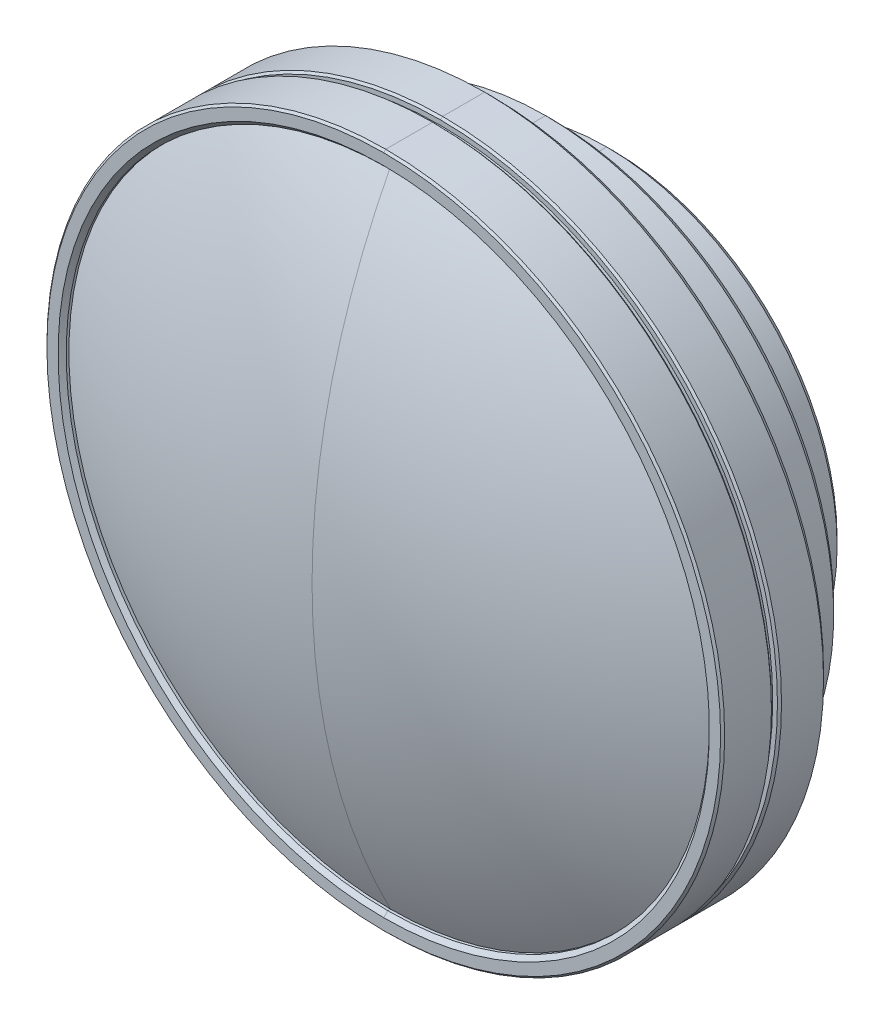
ISO-10303-21;
HEADER;
FILE_DESCRIPTION(('STEP AP214'),'2;1');
FILE_NAME('part.step','',(''),(''),'','','');
FILE_SCHEMA(('AUTOMOTIVE_DESIGN { 1 0 10303 214 1 1 1 1 }'));
ENDSEC;
DATA;
#1=APPLICATION_CONTEXT('core data for automotive mechanical design processes');
#2=APPLICATION_PROTOCOL_DEFINITION('international standard','automotive_design',2000,#1);
#3=PRODUCT_CONTEXT('',#1,'mechanical');
#4=PRODUCT('Part','Part','',(#3));
#5=PRODUCT_RELATED_PRODUCT_CATEGORY('part','',(#4));
#6=PRODUCT_DEFINITION_FORMATION('','',#4);
#7=PRODUCT_DEFINITION_CONTEXT('part definition',#1,'design');
#8=PRODUCT_DEFINITION('design','',#6,#7);
#9=PRODUCT_DEFINITION_SHAPE('','',#8);
#10=(LENGTH_UNIT() NAMED_UNIT(*) SI_UNIT(.MILLI.,.METRE.));
#11=(NAMED_UNIT(*) PLANE_ANGLE_UNIT() SI_UNIT($,.RADIAN.));
#12=(NAMED_UNIT(*) SI_UNIT($,.STERADIAN.) SOLID_ANGLE_UNIT());
#13=UNCERTAINTY_MEASURE_WITH_UNIT(LENGTH_MEASURE(1.E-05),#10,'distance_accuracy_value','');
#14=(GEOMETRIC_REPRESENTATION_CONTEXT(3) GLOBAL_UNCERTAINTY_ASSIGNED_CONTEXT((#13)) GLOBAL_UNIT_ASSIGNED_CONTEXT((#10,
#11,#12)) REPRESENTATION_CONTEXT('',''));
#15=CARTESIAN_POINT('',(0.,0.,0.));
#16=DIRECTION('',(0.,0.,1.));
#17=DIRECTION('',(1.,0.,0.));
#18=AXIS2_PLACEMENT_3D('',#15,#16,#17);
#19=CARTESIAN_POINT('',(0.,0.,9.1));
#20=DIRECTION('',(0.,0.,-1.));
#21=DIRECTION('',(0.,-1.,0.));
#22=AXIS2_PLACEMENT_3D('',#19,#20,#21);
#23=PLANE('',#22);
#24=CARTESIAN_POINT('',(0.,0.,9.1));
#25=DIRECTION('',(0.,0.,-1.));
#26=DIRECTION('',(0.,1.,0.));
#27=AXIS2_PLACEMENT_3D('',#24,#25,#26);
#28=CIRCLE('',#27,23.25);
#29=CARTESIAN_POINT('',(0.,23.25,9.1));
#30=VERTEX_POINT('',#29);
#31=CARTESIAN_POINT('',(0.,-23.25,9.1));
#32=VERTEX_POINT('',#31);
#33=EDGE_CURVE('E325',#30,#32,#28,.T.);
#34=ORIENTED_EDGE('',*,*,#33,.T.);
#35=CARTESIAN_POINT('',(0.,0.,9.1));
#36=DIRECTION('',(0.,0.,1.));
#37=DIRECTION('',(0.,1.,0.));
#38=AXIS2_PLACEMENT_3D('',#35,#36,#37);
#39=CIRCLE('',#38,23.25);
#40=EDGE_CURVE('E354',#30,#32,#39,.T.);
#41=ORIENTED_EDGE('',*,*,#40,.F.);
#42=EDGE_LOOP('',(#34,#41));
#43=FACE_BOUND('',#42,.T.);
#44=ADVANCED_FACE('F15',(#43),#23,.T.);
#45=CARTESIAN_POINT('',(0.,0.,-49.53693829317));
#46=DIRECTION('',(0.,0.,-1.));
#47=DIRECTION('',(0.,-1.,0.));
#48=AXIS2_PLACEMENT_3D('',#45,#46,#47);
#49=SPHERICAL_SURFACE('',#48,103.0057371891);
#50=CARTESIAN_POINT('',(0.,0.,41.8888753147));
#51=DIRECTION('',(0.,0.,1.));
#52=DIRECTION('',(0.,1.,0.));
#53=AXIS2_PLACEMENT_3D('',#50,#51,#52);
#54=CIRCLE('',#53,47.45);
#55=CARTESIAN_POINT('',(0.,47.45,41.8888753147));
#56=VERTEX_POINT('',#55);
#57=CARTESIAN_POINT('',(0.,-47.45,41.8888753147));
#58=VERTEX_POINT('',#57);
#59=EDGE_CURVE('E344',#56,#58,#54,.T.);
#60=ORIENTED_EDGE('',*,*,#59,.T.);
#61=CARTESIAN_POINT('',(0.,0.,-49.53693829317));
#62=DIRECTION('',(-1.,0.,0.));
#63=DIRECTION('',(0.,-0.460653952826992,0.887579819365485));
#64=AXIS2_PLACEMENT_3D('',#61,#62,#63);
#65=CIRCLE('',#64,103.0057371891);
#66=CARTESIAN_POINT('',(0.,0.,53.46879889588));
#67=VERTEX_POINT('',#66);
#68=EDGE_CURVE('E26',#58,#67,#65,.T.);
#69=ORIENTED_EDGE('',*,*,#68,.T.);
#70=CARTESIAN_POINT('',(0.,0.,-49.53693829317));
#71=DIRECTION('',(1.,0.,0.));
#72=DIRECTION('',(0.,0.460653952826992,0.887579819365485));
#73=AXIS2_PLACEMENT_3D('',#70,#71,#72);
#74=CIRCLE('',#73,103.0057371891);
#75=EDGE_CURVE('E10',#56,#67,#74,.T.);
#76=ORIENTED_EDGE('',*,*,#75,.F.);
#77=EDGE_LOOP('',(#60,#69,#76));
#78=FACE_BOUND('',#77,.T.);
#79=ADVANCED_FACE('F531',(#78),#49,.T.);
#80=CARTESIAN_POINT('',(0.,0.,-49.53693829317));
#81=DIRECTION('',(0.,0.,-1.));
#82=DIRECTION('',(0.,-1.,0.));
#83=AXIS2_PLACEMENT_3D('',#80,#81,#82);
#84=SPHERICAL_SURFACE('',#83,103.0057371891);
#85=ORIENTED_EDGE('',*,*,#68,.F.);
#86=CARTESIAN_POINT('',(0.,0.,41.8888753147));
#87=DIRECTION('',(0.,0.,-1.));
#88=DIRECTION('',(0.,1.,0.));
#89=AXIS2_PLACEMENT_3D('',#86,#87,#88);
#90=CIRCLE('',#89,47.45);
#91=EDGE_CURVE('E310',#56,#58,#90,.T.);
#92=ORIENTED_EDGE('',*,*,#91,.F.);
#93=ORIENTED_EDGE('',*,*,#75,.T.);
#94=EDGE_LOOP('',(#85,#92,#93));
#95=FACE_BOUND('',#94,.T.);
#96=ADVANCED_FACE('F537',(#95),#84,.T.);
#97=CARTESIAN_POINT('',(0.,0.,56.14223884068));
#98=DIRECTION('',(0.,0.,-1.));
#99=DIRECTION('',(0.,-1.,0.));
#100=AXIS2_PLACEMENT_3D('',#97,#98,#99);
#101=CYLINDRICAL_SURFACE('',#100,47.45);
#102=ORIENTED_EDGE('',*,*,#91,.T.);
#103=DIRECTION('',(0.,0.,-1.));
#104=VECTOR('',#103,1.);
#105=CARTESIAN_POINT('',(0.,-47.45,42.2888753147));
#106=LINE('',#105,#104);
#107=CARTESIAN_POINT('',(0.,-47.45,42.2888753147));
#108=VERTEX_POINT('',#107);
#109=EDGE_CURVE('E340',#108,#58,#106,.T.);
#110=ORIENTED_EDGE('',*,*,#109,.F.);
#111=CARTESIAN_POINT('',(0.,0.,42.2888753147));
#112=DIRECTION('',(0.,0.,-1.));
#113=DIRECTION('',(0.,1.,0.));
#114=AXIS2_PLACEMENT_3D('',#111,#112,#113);
#115=CIRCLE('',#114,47.45);
#116=CARTESIAN_POINT('',(0.,47.45,42.2888753147));
#117=VERTEX_POINT('',#116);
#118=EDGE_CURVE('E451',#117,#108,#115,.T.);
#119=ORIENTED_EDGE('',*,*,#118,.F.);
#120=DIRECTION('',(0.,0.,-1.));
#121=VECTOR('',#120,1.);
#122=CARTESIAN_POINT('',(0.,47.45,42.2888753147));
#123=LINE('',#122,#121);
#124=EDGE_CURVE('E398',#117,#56,#123,.T.);
#125=ORIENTED_EDGE('',*,*,#124,.T.);
#126=EDGE_LOOP('',(#102,#110,#119,#125));
#127=FACE_BOUND('',#126,.T.);
#128=ADVANCED_FACE('F555',(#127),#101,.F.);
#129=CARTESIAN_POINT('',(0.,0.,56.14223884068));
#130=DIRECTION('',(0.,0.,-1.));
#131=DIRECTION('',(0.,-1.,0.));
#132=AXIS2_PLACEMENT_3D('',#129,#130,#131);
#133=CYLINDRICAL_SURFACE('',#132,47.45);
#134=CARTESIAN_POINT('',(0.,0.,42.2888753147));
#135=DIRECTION('',(0.,0.,1.));
#136=DIRECTION('',(0.,1.,0.));
#137=AXIS2_PLACEMENT_3D('',#134,#135,#136);
#138=CIRCLE('',#137,47.45);
#139=EDGE_CURVE('E270',#117,#108,#138,.T.);
#140=ORIENTED_EDGE('',*,*,#139,.T.);
#141=ORIENTED_EDGE('',*,*,#109,.T.);
#142=ORIENTED_EDGE('',*,*,#59,.F.);
#143=ORIENTED_EDGE('',*,*,#124,.F.);
#144=EDGE_LOOP('',(#140,#141,#142,#143));
#145=FACE_BOUND('',#144,.T.);
#146=ADVANCED_FACE('F558',(#145),#133,.F.);
#147=CARTESIAN_POINT('',(0.,0.,42.5888753147));
#148=DIRECTION('',(0.,0.,1.));
#149=DIRECTION('',(0.,1.,0.));
#150=AXIS2_PLACEMENT_3D('',#147,#148,#149);
#151=CONICAL_SURFACE('',#150,47.75,0.785398163397125);
#152=CARTESIAN_POINT('',(0.,0.,42.8888753147));
#153=DIRECTION('',(0.,0.,1.));
#154=DIRECTION('',(0.,1.,0.));
#155=AXIS2_PLACEMENT_3D('',#152,#153,#154);
#156=CIRCLE('',#155,48.05);
#157=CARTESIAN_POINT('',(0.,48.05,42.8888753147));
#158=VERTEX_POINT('',#157);
#159=CARTESIAN_POINT('',(0.,-48.05,42.8888753147));
#160=VERTEX_POINT('',#159);
#161=EDGE_CURVE('E335',#158,#160,#156,.T.);
#162=ORIENTED_EDGE('',*,*,#161,.T.);
#163=DIRECTION('',(0.,0.707106781186398,-0.707106781186698));
#164=VECTOR('',#163,1.);
#165=CARTESIAN_POINT('',(0.,-48.05,42.8888753147));
#166=LINE('',#165,#164);
#167=EDGE_CURVE('E271',#160,#108,#166,.T.);
#168=ORIENTED_EDGE('',*,*,#167,.T.);
#169=ORIENTED_EDGE('',*,*,#139,.F.);
#170=DIRECTION('',(0.,-0.707106781186398,-0.707106781186698));
#171=VECTOR('',#170,1.);
#172=CARTESIAN_POINT('',(0.,48.05,42.8888753147));
#173=LINE('',#172,#171);
#174=EDGE_CURVE('E266',#158,#117,#173,.T.);
#175=ORIENTED_EDGE('',*,*,#174,.F.);
#176=EDGE_LOOP('',(#162,#168,#169,#175));
#177=FACE_BOUND('',#176,.T.);
#178=ADVANCED_FACE('F622',(#177),#151,.F.);
#179=CARTESIAN_POINT('',(0.,0.,42.5888753147));
#180=DIRECTION('',(0.,0.,1.));
#181=DIRECTION('',(0.,1.,0.));
#182=AXIS2_PLACEMENT_3D('',#179,#180,#181);
#183=CONICAL_SURFACE('',#182,47.75,0.785398163397125);
#184=ORIENTED_EDGE('',*,*,#118,.T.);
#185=ORIENTED_EDGE('',*,*,#167,.F.);
#186=CARTESIAN_POINT('',(0.,0.,42.8888753147));
#187=DIRECTION('',(0.,0.,-1.));
#188=DIRECTION('',(0.,1.,0.));
#189=AXIS2_PLACEMENT_3D('',#186,#187,#188);
#190=CIRCLE('',#189,48.05);
#191=EDGE_CURVE('E338',#158,#160,#190,.T.);
#192=ORIENTED_EDGE('',*,*,#191,.F.);
#193=ORIENTED_EDGE('',*,*,#174,.T.);
#194=EDGE_LOOP('',(#184,#185,#192,#193));
#195=FACE_BOUND('',#194,.T.);
#196=ADVANCED_FACE('F624',(#195),#183,.F.);
#197=CARTESIAN_POINT('',(0.,0.,42.8888753147));
#198=DIRECTION('',(0.,0.,-1.));
#199=DIRECTION('',(0.,-1.,0.));
#200=AXIS2_PLACEMENT_3D('',#197,#198,#199);
#201=PLANE('',#200);
#202=ORIENTED_EDGE('',*,*,#161,.F.);
#203=ORIENTED_EDGE('',*,*,#191,.T.);
#204=EDGE_LOOP('',(#202,#203));
#205=FACE_BOUND('',#204,.T.);
#206=CARTESIAN_POINT('',(0.,0.,42.88887531506));
#207=DIRECTION('',(0.,0.,-1.));
#208=DIRECTION('',(0.,1.,0.));
#209=AXIS2_PLACEMENT_3D('',#206,#207,#208);
#210=CIRCLE('',#209,49.69999999964);
#211=CARTESIAN_POINT('',(0.,49.69999999976,42.88887531494));
#212=VERTEX_POINT('',#211);
#213=CARTESIAN_POINT('',(0.,-49.69999999976,42.88887531494));
#214=VERTEX_POINT('',#213);
#215=EDGE_CURVE('E299',#212,#214,#210,.T.);
#216=ORIENTED_EDGE('',*,*,#215,.F.);
#217=CARTESIAN_POINT('',(0.,0.,42.88887531506));
#218=DIRECTION('',(0.,0.,1.));
#219=DIRECTION('',(0.,1.,0.));
#220=AXIS2_PLACEMENT_3D('',#217,#218,#219);
#221=CIRCLE('',#220,49.69999999964);
#222=EDGE_CURVE('E334',#212,#214,#221,.T.);
#223=ORIENTED_EDGE('',*,*,#222,.T.);
#224=EDGE_LOOP('',(#216,#223));
#225=FACE_BOUND('',#224,.T.);
#226=ADVANCED_FACE('F547',(#205,#225),#201,.F.);
#227=CARTESIAN_POINT('',(0.,0.,42.73887531488));
#228=DIRECTION('',(0.,0.,-1.));
#229=DIRECTION('',(0.,-1.,0.));
#230=AXIS2_PLACEMENT_3D('',#227,#228,#229);
#231=CONICAL_SURFACE('',#230,49.84999999982,0.7853981633973);
#232=CARTESIAN_POINT('',(0.,0.,42.5888753147));
#233=DIRECTION('',(0.,0.,1.));
#234=DIRECTION('',(0.,1.,0.));
#235=AXIS2_PLACEMENT_3D('',#232,#233,#234);
#236=CIRCLE('',#235,50.);
#237=CARTESIAN_POINT('',(0.,50.,42.5888753147));
#238=VERTEX_POINT('',#237);
#239=CARTESIAN_POINT('',(0.,-50.,42.5888753147));
#240=VERTEX_POINT('',#239);
#241=EDGE_CURVE('E424',#238,#240,#236,.T.);
#242=ORIENTED_EDGE('',*,*,#241,.T.);
#243=DIRECTION('',(0.,0.707106781186598,0.707106781186498));
#244=VECTOR('',#243,1.);
#245=CARTESIAN_POINT('',(0.,-50.,42.5888753147));
#246=LINE('',#245,#244);
#247=EDGE_CURVE('E303',#240,#214,#246,.T.);
#248=ORIENTED_EDGE('',*,*,#247,.T.);
#249=ORIENTED_EDGE('',*,*,#222,.F.);
#250=DIRECTION('',(0.,-0.707106781186598,0.707106781186498));
#251=VECTOR('',#250,1.);
#252=CARTESIAN_POINT('',(0.,50.,42.5888753147));
#253=LINE('',#252,#251);
#254=EDGE_CURVE('E330',#238,#212,#253,.T.);
#255=ORIENTED_EDGE('',*,*,#254,.F.);
#256=EDGE_LOOP('',(#242,#248,#249,#255));
#257=FACE_BOUND('',#256,.T.);
#258=ADVANCED_FACE('F543',(#257),#231,.T.);
#259=CARTESIAN_POINT('',(0.,0.,42.73887531488));
#260=DIRECTION('',(0.,0.,-1.));
#261=DIRECTION('',(0.,-1.,0.));
#262=AXIS2_PLACEMENT_3D('',#259,#260,#261);
#263=CONICAL_SURFACE('',#262,49.84999999982,0.7853981633973);
#264=ORIENTED_EDGE('',*,*,#215,.T.);
#265=ORIENTED_EDGE('',*,*,#247,.F.);
#266=CARTESIAN_POINT('',(0.,0.,42.5888753147));
#267=DIRECTION('',(0.,0.,-1.));
#268=DIRECTION('',(0.,1.,0.));
#269=AXIS2_PLACEMENT_3D('',#266,#267,#268);
#270=CIRCLE('',#269,50.);
#271=EDGE_CURVE('E304',#238,#240,#270,.T.);
#272=ORIENTED_EDGE('',*,*,#271,.F.);
#273=ORIENTED_EDGE('',*,*,#254,.T.);
#274=EDGE_LOOP('',(#264,#265,#272,#273));
#275=FACE_BOUND('',#274,.T.);
#276=ADVANCED_FACE('F546',(#275),#263,.T.);
#277=CARTESIAN_POINT('',(0.,0.,56.14223884068));
#278=DIRECTION('',(0.,0.,-1.));
#279=DIRECTION('',(0.,-1.,0.));
#280=AXIS2_PLACEMENT_3D('',#277,#278,#279);
#281=CYLINDRICAL_SURFACE('',#280,50.);
#282=ORIENTED_EDGE('',*,*,#271,.T.);
#283=DIRECTION('',(0.,0.,1.));
#284=VECTOR('',#283,1.);
#285=CARTESIAN_POINT('',(0.,-50.,35.6888753147));
#286=LINE('',#285,#284);
#287=CARTESIAN_POINT('',(0.,-50.,35.6888753147));
#288=VERTEX_POINT('',#287);
#289=EDGE_CURVE('E378',#288,#240,#286,.T.);
#290=ORIENTED_EDGE('',*,*,#289,.F.);
#291=CARTESIAN_POINT('',(0.,0.,35.6888753147));
#292=DIRECTION('',(0.,0.,-1.));
#293=DIRECTION('',(0.,1.,0.));
#294=AXIS2_PLACEMENT_3D('',#291,#292,#293);
#295=CIRCLE('',#294,50.);
#296=CARTESIAN_POINT('',(0.,50.,35.6888753147));
#297=VERTEX_POINT('',#296);
#298=EDGE_CURVE('E247',#297,#288,#295,.T.);
#299=ORIENTED_EDGE('',*,*,#298,.F.);
#300=DIRECTION('',(0.,0.,1.));
#301=VECTOR('',#300,1.);
#302=CARTESIAN_POINT('',(0.,50.,35.6888753147));
#303=LINE('',#302,#301);
#304=EDGE_CURVE('E421',#297,#238,#303,.T.);
#305=ORIENTED_EDGE('',*,*,#304,.T.);
#306=EDGE_LOOP('',(#282,#290,#299,#305));
#307=FACE_BOUND('',#306,.T.);
#308=ADVANCED_FACE('F610',(#307),#281,.T.);
#309=CARTESIAN_POINT('',(0.,0.,56.14223884068));
#310=DIRECTION('',(0.,0.,-1.));
#311=DIRECTION('',(0.,-1.,0.));
#312=AXIS2_PLACEMENT_3D('',#309,#310,#311);
#313=CYLINDRICAL_SURFACE('',#312,50.);
#314=CARTESIAN_POINT('',(0.,0.,35.6888753147));
#315=DIRECTION('',(0.,0.,1.));
#316=DIRECTION('',(0.,1.,0.));
#317=AXIS2_PLACEMENT_3D('',#314,#315,#316);
#318=CIRCLE('',#317,50.);
#319=EDGE_CURVE('E374',#297,#288,#318,.T.);
#320=ORIENTED_EDGE('',*,*,#319,.T.);
#321=ORIENTED_EDGE('',*,*,#289,.T.);
#322=ORIENTED_EDGE('',*,*,#241,.F.);
#323=ORIENTED_EDGE('',*,*,#304,.F.);
#324=EDGE_LOOP('',(#320,#321,#322,#323));
#325=FACE_BOUND('',#324,.T.);
#326=ADVANCED_FACE('F606',(#325),#313,.T.);
#327=CARTESIAN_POINT('',(0.,0.,35.53887531459));
#328=DIRECTION('',(0.,0.,1.));
#329=DIRECTION('',(0.,1.,0.));
#330=AXIS2_PLACEMENT_3D('',#327,#328,#329);
#331=CONICAL_SURFACE('',#330,49.8499999999,0.7853981633973);
#332=CARTESIAN_POINT('',(0.,0.,35.38887531449));
#333=DIRECTION('',(0.,0.,1.));
#334=DIRECTION('',(0.,1.,0.));
#335=AXIS2_PLACEMENT_3D('',#332,#333,#334);
#336=CIRCLE('',#335,49.69999999979);
#337=CARTESIAN_POINT('',(0.,49.69999999979,35.38887531449));
#338=VERTEX_POINT('',#337);
#339=CARTESIAN_POINT('',(0.,-49.69999999979,35.38887531449));
#340=VERTEX_POINT('',#339);
#341=EDGE_CURVE('E280',#338,#340,#336,.T.);
#342=ORIENTED_EDGE('',*,*,#341,.T.);
#343=DIRECTION('',(0.,-0.707106781186498,0.707106781186597));
#344=VECTOR('',#343,1.);
#345=CARTESIAN_POINT('',(0.,-49.69999999979,35.38887531449));
#346=LINE('',#345,#344);
#347=EDGE_CURVE('E251',#340,#288,#346,.T.);
#348=ORIENTED_EDGE('',*,*,#347,.T.);
#349=ORIENTED_EDGE('',*,*,#319,.F.);
#350=DIRECTION('',(0.,0.707106781186498,0.707106781186597));
#351=VECTOR('',#350,1.);
#352=CARTESIAN_POINT('',(0.,49.69999999979,35.38887531449));
#353=LINE('',#352,#351);
#354=EDGE_CURVE('E19',#338,#297,#353,.T.);
#355=ORIENTED_EDGE('',*,*,#354,.F.);
#356=EDGE_LOOP('',(#342,#348,#349,#355));
#357=FACE_BOUND('',#356,.T.);
#358=ADVANCED_FACE('F609',(#357),#331,.T.);
#359=CARTESIAN_POINT('',(0.,0.,35.53887531459));
#360=DIRECTION('',(0.,0.,1.));
#361=DIRECTION('',(0.,1.,0.));
#362=AXIS2_PLACEMENT_3D('',#359,#360,#361);
#363=CONICAL_SURFACE('',#362,49.8499999999,0.7853981633973);
#364=ORIENTED_EDGE('',*,*,#298,.T.);
#365=ORIENTED_EDGE('',*,*,#347,.F.);
#366=CARTESIAN_POINT('',(0.,0.,35.38887531449));
#367=DIRECTION('',(0.,0.,-1.));
#368=DIRECTION('',(0.,1.,0.));
#369=AXIS2_PLACEMENT_3D('',#366,#367,#368);
#370=CIRCLE('',#369,49.69999999979);
#371=EDGE_CURVE('E252',#338,#340,#370,.T.);
#372=ORIENTED_EDGE('',*,*,#371,.F.);
#373=ORIENTED_EDGE('',*,*,#354,.T.);
#374=EDGE_LOOP('',(#364,#365,#372,#373));
#375=FACE_BOUND('',#374,.T.);
#376=ADVANCED_FACE('F659',(#375),#363,.T.);
#377=CARTESIAN_POINT('',(0.,0.,35.38887531449));
#378=DIRECTION('',(0.,0.,-1.));
#379=DIRECTION('',(0.,-1.,0.));
#380=AXIS2_PLACEMENT_3D('',#377,#378,#379);
#381=PLANE('',#380);
#382=CARTESIAN_POINT('',(0.,0.,35.38887531449));
#383=DIRECTION('',(0.,0.,-1.));
#384=DIRECTION('',(0.,1.,0.));
#385=AXIS2_PLACEMENT_3D('',#382,#383,#384);
#386=CIRCLE('',#385,49.);
#387=CARTESIAN_POINT('',(0.,49.,35.38887531449));
#388=VERTEX_POINT('',#387);
#389=CARTESIAN_POINT('',(0.,-49.,35.38887531449));
#390=VERTEX_POINT('',#389);
#391=EDGE_CURVE('E227',#388,#390,#386,.T.);
#392=ORIENTED_EDGE('',*,*,#391,.F.);
#393=CARTESIAN_POINT('',(0.,0.,35.38887531449));
#394=DIRECTION('',(0.,0.,1.));
#395=DIRECTION('',(0.,1.,0.));
#396=AXIS2_PLACEMENT_3D('',#393,#394,#395);
#397=CIRCLE('',#396,49.);
#398=EDGE_CURVE('E215',#388,#390,#397,.T.);
#399=ORIENTED_EDGE('',*,*,#398,.T.);
#400=EDGE_LOOP('',(#392,#399));
#401=FACE_BOUND('',#400,.T.);
#402=ORIENTED_EDGE('',*,*,#341,.F.);
#403=ORIENTED_EDGE('',*,*,#371,.T.);
#404=EDGE_LOOP('',(#402,#403));
#405=FACE_BOUND('',#404,.T.);
#406=ADVANCED_FACE('F662',(#401,#405),#381,.T.);
#407=CARTESIAN_POINT('',(0.,0.,56.14223884068));
#408=DIRECTION('',(0.,0.,-1.));
#409=DIRECTION('',(0.,-1.,0.));
#410=AXIS2_PLACEMENT_3D('',#407,#408,#409);
#411=CYLINDRICAL_SURFACE('',#410,49.);
#412=CARTESIAN_POINT('',(0.,0.,34.5));
#413=DIRECTION('',(0.,0.,1.));
#414=DIRECTION('',(0.,1.,0.));
#415=AXIS2_PLACEMENT_3D('',#412,#413,#414);
#416=CIRCLE('',#415,49.);
#417=CARTESIAN_POINT('',(0.,49.,34.5));
#418=VERTEX_POINT('',#417);
#419=CARTESIAN_POINT('',(0.,-49.,34.5));
#420=VERTEX_POINT('',#419);
#421=EDGE_CURVE('E214',#418,#420,#416,.T.);
#422=ORIENTED_EDGE('',*,*,#421,.T.);
#423=DIRECTION('',(0.,0.,1.));
#424=VECTOR('',#423,1.);
#425=CARTESIAN_POINT('',(0.,-49.,34.5));
#426=LINE('',#425,#424);
#427=EDGE_CURVE('E220',#420,#390,#426,.T.);
#428=ORIENTED_EDGE('',*,*,#427,.T.);
#429=ORIENTED_EDGE('',*,*,#398,.F.);
#430=DIRECTION('',(0.,0.,1.));
#431=VECTOR('',#430,1.);
#432=CARTESIAN_POINT('',(0.,49.,34.5));
#433=LINE('',#432,#431);
#434=EDGE_CURVE('E210',#418,#388,#433,.T.);
#435=ORIENTED_EDGE('',*,*,#434,.F.);
#436=EDGE_LOOP('',(#422,#428,#429,#435));
#437=FACE_BOUND('',#436,.T.);
#438=ADVANCED_FACE('F17',(#437),#411,.T.);
#439=CARTESIAN_POINT('',(0.,0.,56.14223884068));
#440=DIRECTION('',(0.,0.,-1.));
#441=DIRECTION('',(0.,-1.,0.));
#442=AXIS2_PLACEMENT_3D('',#439,#440,#441);
#443=CYLINDRICAL_SURFACE('',#442,49.);
#444=ORIENTED_EDGE('',*,*,#391,.T.);
#445=ORIENTED_EDGE('',*,*,#427,.F.);
#446=CARTESIAN_POINT('',(0.,0.,34.5));
#447=DIRECTION('',(0.,0.,-1.));
#448=DIRECTION('',(0.,1.,0.));
#449=AXIS2_PLACEMENT_3D('',#446,#447,#448);
#450=CIRCLE('',#449,49.);
#451=EDGE_CURVE('E223',#418,#420,#450,.T.);
#452=ORIENTED_EDGE('',*,*,#451,.F.);
#453=ORIENTED_EDGE('',*,*,#434,.T.);
#454=EDGE_LOOP('',(#444,#445,#452,#453));
#455=FACE_BOUND('',#454,.T.);
#456=ADVANCED_FACE('F224',(#455),#443,.T.);
#457=CARTESIAN_POINT('',(0.,0.,34.5));
#458=DIRECTION('',(0.,0.,-1.));
#459=DIRECTION('',(0.,-1.,0.));
#460=AXIS2_PLACEMENT_3D('',#457,#458,#459);
#461=PLANE('',#460);
#462=ORIENTED_EDGE('',*,*,#421,.F.);
#463=ORIENTED_EDGE('',*,*,#451,.T.);
#464=EDGE_LOOP('',(#462,#463));
#465=FACE_BOUND('',#464,.T.);
#466=CARTESIAN_POINT('',(0.,0.,34.50000000037));
#467=DIRECTION('',(0.,0.,-1.));
#468=DIRECTION('',(0.,1.,0.));
#469=AXIS2_PLACEMENT_3D('',#466,#467,#468);
#470=CIRCLE('',#469,49.69999999963);
#471=CARTESIAN_POINT('',(0.,49.69999999975,34.50000000025));
#472=VERTEX_POINT('',#471);
#473=CARTESIAN_POINT('',(0.,-49.69999999975,34.50000000025));
#474=VERTEX_POINT('',#473);
#475=EDGE_CURVE('E272',#472,#474,#470,.T.);
#476=ORIENTED_EDGE('',*,*,#475,.F.);
#477=CARTESIAN_POINT('',(0.,0.,34.50000000037));
#478=DIRECTION('',(0.,0.,1.));
#479=DIRECTION('',(0.,1.,0.));
#480=AXIS2_PLACEMENT_3D('',#477,#478,#479);
#481=CIRCLE('',#480,49.69999999963);
#482=EDGE_CURVE('E232',#472,#474,#481,.T.);
#483=ORIENTED_EDGE('',*,*,#482,.T.);
#484=EDGE_LOOP('',(#476,#483));
#485=FACE_BOUND('',#484,.T.);
#486=ADVANCED_FACE('F229',(#465,#485),#461,.F.);
#487=CARTESIAN_POINT('',(0.,0.,34.35000000019));
#488=DIRECTION('',(0.,0.,-1.));
#489=DIRECTION('',(0.,-1.,0.));
#490=AXIS2_PLACEMENT_3D('',#487,#488,#489);
#491=CONICAL_SURFACE('',#490,49.84999999981,0.7853981633973);
#492=CARTESIAN_POINT('',(0.,0.,34.2));
#493=DIRECTION('',(0.,0.,1.));
#494=DIRECTION('',(0.,1.,0.));
#495=AXIS2_PLACEMENT_3D('',#492,#493,#494);
#496=CIRCLE('',#495,50.);
#497=CARTESIAN_POINT('',(0.,50.,34.2));
#498=VERTEX_POINT('',#497);
#499=CARTESIAN_POINT('',(0.,-50.,34.2));
#500=VERTEX_POINT('',#499);
#501=EDGE_CURVE('E293',#498,#500,#496,.T.);
#502=ORIENTED_EDGE('',*,*,#501,.T.);
#503=DIRECTION('',(0.,0.707106781186597,0.707106781186498));
#504=VECTOR('',#503,1.);
#505=CARTESIAN_POINT('',(0.,-50.,34.2));
#506=LINE('',#505,#504);
#507=EDGE_CURVE('E276',#500,#474,#506,.T.);
#508=ORIENTED_EDGE('',*,*,#507,.T.);
#509=ORIENTED_EDGE('',*,*,#482,.F.);
#510=DIRECTION('',(0.,-0.707106781186597,0.707106781186498));
#511=VECTOR('',#510,1.);
#512=CARTESIAN_POINT('',(0.,50.,34.2));
#513=LINE('',#512,#511);
#514=EDGE_CURVE('E238',#498,#472,#513,.T.);
#515=ORIENTED_EDGE('',*,*,#514,.F.);
#516=EDGE_LOOP('',(#502,#508,#509,#515));
#517=FACE_BOUND('',#516,.T.);
#518=ADVANCED_FACE('F569',(#517),#491,.T.);
#519=CARTESIAN_POINT('',(0.,0.,34.35000000019));
#520=DIRECTION('',(0.,0.,-1.));
#521=DIRECTION('',(0.,-1.,0.));
#522=AXIS2_PLACEMENT_3D('',#519,#520,#521);
#523=CONICAL_SURFACE('',#522,49.84999999981,0.7853981633973);
#524=ORIENTED_EDGE('',*,*,#475,.T.);
#525=ORIENTED_EDGE('',*,*,#507,.F.);
#526=CARTESIAN_POINT('',(0.,0.,34.2));
#527=DIRECTION('',(0.,0.,-1.));
#528=DIRECTION('',(0.,1.,0.));
#529=AXIS2_PLACEMENT_3D('',#526,#527,#528);
#530=CIRCLE('',#529,50.);
#531=EDGE_CURVE('E277',#498,#500,#530,.T.);
#532=ORIENTED_EDGE('',*,*,#531,.F.);
#533=ORIENTED_EDGE('',*,*,#514,.T.);
#534=EDGE_LOOP('',(#524,#525,#532,#533));
#535=FACE_BOUND('',#534,.T.);
#536=ADVANCED_FACE('F567',(#535),#523,.T.);
#537=CARTESIAN_POINT('',(0.,0.,56.14223884068));
#538=DIRECTION('',(0.,0.,-1.));
#539=DIRECTION('',(0.,-1.,0.));
#540=AXIS2_PLACEMENT_3D('',#537,#538,#539);
#541=CYLINDRICAL_SURFACE('',#540,50.);
#542=ORIENTED_EDGE('',*,*,#531,.T.);
#543=DIRECTION('',(0.,0.,1.));
#544=VECTOR('',#543,1.);
#545=CARTESIAN_POINT('',(0.,-50.,28.));
#546=LINE('',#545,#544);
#547=CARTESIAN_POINT('',(0.,-50.,28.));
#548=VERTEX_POINT('',#547);
#549=EDGE_CURVE('E298',#548,#500,#546,.T.);
#550=ORIENTED_EDGE('',*,*,#549,.F.);
#551=CARTESIAN_POINT('',(0.,0.,28.));
#552=DIRECTION('',(0.,0.,-1.));
#553=DIRECTION('',(0.,1.,0.));
#554=AXIS2_PLACEMENT_3D('',#551,#552,#553);
#555=CIRCLE('',#554,50.);
#556=CARTESIAN_POINT('',(0.,50.,28.));
#557=VERTEX_POINT('',#556);
#558=EDGE_CURVE('E292',#557,#548,#555,.T.);
#559=ORIENTED_EDGE('',*,*,#558,.F.);
#560=DIRECTION('',(0.,0.,1.));
#561=VECTOR('',#560,1.);
#562=CARTESIAN_POINT('',(0.,50.,28.));
#563=LINE('',#562,#561);
#564=EDGE_CURVE('E297',#557,#498,#563,.T.);
#565=ORIENTED_EDGE('',*,*,#564,.T.);
#566=EDGE_LOOP('',(#542,#550,#559,#565));
#567=FACE_BOUND('',#566,.T.);
#568=ADVANCED_FACE('F563',(#567),#541,.T.);
#569=CARTESIAN_POINT('',(0.,0.,56.14223884068));
#570=DIRECTION('',(0.,0.,-1.));
#571=DIRECTION('',(0.,-1.,0.));
#572=AXIS2_PLACEMENT_3D('',#569,#570,#571);
#573=CYLINDRICAL_SURFACE('',#572,50.);
#574=CARTESIAN_POINT('',(0.,0.,28.));
#575=DIRECTION('',(0.,0.,1.));
#576=DIRECTION('',(0.,1.,0.));
#577=AXIS2_PLACEMENT_3D('',#574,#575,#576);
#578=CIRCLE('',#577,50.);
#579=EDGE_CURVE('E420',#557,#548,#578,.T.);
#580=ORIENTED_EDGE('',*,*,#579,.T.);
#581=ORIENTED_EDGE('',*,*,#549,.T.);
#582=ORIENTED_EDGE('',*,*,#501,.F.);
#583=ORIENTED_EDGE('',*,*,#564,.F.);
#584=EDGE_LOOP('',(#580,#581,#582,#583));
#585=FACE_BOUND('',#584,.T.);
#586=ADVANCED_FACE('F560',(#585),#573,.T.);
#587=CARTESIAN_POINT('',(0.,0.,27.49999999991));
#588=DIRECTION('',(0.,0.,1.));
#589=DIRECTION('',(0.,1.,0.));
#590=AXIS2_PLACEMENT_3D('',#587,#588,#589);
#591=CONICAL_SURFACE('',#590,49.49999999991,0.7853981633973);
#592=CARTESIAN_POINT('',(0.,0.,26.99999999982));
#593=DIRECTION('',(0.,0.,1.));
#594=DIRECTION('',(0.,1.,0.));
#595=AXIS2_PLACEMENT_3D('',#592,#593,#594);
#596=CIRCLE('',#595,48.99999999982);
#597=CARTESIAN_POINT('',(0.,48.99999999982,26.99999999982));
#598=VERTEX_POINT('',#597);
#599=CARTESIAN_POINT('',(0.,-48.99999999982,26.99999999982));
#600=VERTEX_POINT('',#599);
#601=EDGE_CURVE('E256',#598,#600,#596,.T.);
#602=ORIENTED_EDGE('',*,*,#601,.T.);
#603=DIRECTION('',(0.,-0.707106781186498,0.707106781186597));
#604=VECTOR('',#603,1.);
#605=CARTESIAN_POINT('',(0.,-48.99999999982,26.99999999982));
#606=LINE('',#605,#604);
#607=EDGE_CURVE('E358',#600,#548,#606,.T.);
#608=ORIENTED_EDGE('',*,*,#607,.T.);
#609=ORIENTED_EDGE('',*,*,#579,.F.);
#610=DIRECTION('',(0.,0.707106781186498,0.707106781186597));
#611=VECTOR('',#610,1.);
#612=CARTESIAN_POINT('',(0.,48.99999999982,26.99999999982));
#613=LINE('',#612,#611);
#614=EDGE_CURVE('E392',#598,#557,#613,.T.);
#615=ORIENTED_EDGE('',*,*,#614,.F.);
#616=EDGE_LOOP('',(#602,#608,#609,#615));
#617=FACE_BOUND('',#616,.T.);
#618=ADVANCED_FACE('F562',(#617),#591,.T.);
#619=CARTESIAN_POINT('',(0.,0.,27.49999999991));
#620=DIRECTION('',(0.,0.,1.));
#621=DIRECTION('',(0.,1.,0.));
#622=AXIS2_PLACEMENT_3D('',#619,#620,#621);
#623=CONICAL_SURFACE('',#622,49.49999999991,0.7853981633973);
#624=ORIENTED_EDGE('',*,*,#558,.T.);
#625=ORIENTED_EDGE('',*,*,#607,.F.);
#626=CARTESIAN_POINT('',(0.,0.,26.99999999982));
#627=DIRECTION('',(0.,0.,-1.));
#628=DIRECTION('',(0.,1.,0.));
#629=AXIS2_PLACEMENT_3D('',#626,#627,#628);
#630=CIRCLE('',#629,48.99999999982);
#631=EDGE_CURVE('E265',#598,#600,#630,.T.);
#632=ORIENTED_EDGE('',*,*,#631,.F.);
#633=ORIENTED_EDGE('',*,*,#614,.T.);
#634=EDGE_LOOP('',(#624,#625,#632,#633));
#635=FACE_BOUND('',#634,.T.);
#636=ADVANCED_FACE('F588',(#635),#623,.T.);
#637=CARTESIAN_POINT('',(0.,0.,26.99999999982));
#638=DIRECTION('',(0.,0.,-1.));
#639=DIRECTION('',(0.,-1.,0.));
#640=AXIS2_PLACEMENT_3D('',#637,#638,#639);
#641=PLANE('',#640);
#642=CARTESIAN_POINT('',(0.,0.,26.99999999982));
#643=DIRECTION('',(0.,0.,-1.));
#644=DIRECTION('',(0.,1.,0.));
#645=AXIS2_PLACEMENT_3D('',#642,#643,#644);
#646=CIRCLE('',#645,42.5);
#647=CARTESIAN_POINT('',(0.,42.5,26.99999999982));
#648=VERTEX_POINT('',#647);
#649=CARTESIAN_POINT('',(0.,-42.5,26.99999999982));
#650=VERTEX_POINT('',#649);
#651=EDGE_CURVE('E253',#648,#650,#646,.T.);
#652=ORIENTED_EDGE('',*,*,#651,.F.);
#653=CARTESIAN_POINT('',(0.,0.,26.99999999982));
#654=DIRECTION('',(0.,0.,1.));
#655=DIRECTION('',(0.,1.,0.));
#656=AXIS2_PLACEMENT_3D('',#653,#654,#655);
#657=CIRCLE('',#656,42.5);
#658=EDGE_CURVE('E370',#648,#650,#657,.T.);
#659=ORIENTED_EDGE('',*,*,#658,.T.);
#660=EDGE_LOOP('',(#652,#659));
#661=FACE_BOUND('',#660,.T.);
#662=ORIENTED_EDGE('',*,*,#601,.F.);
#663=ORIENTED_EDGE('',*,*,#631,.T.);
#664=EDGE_LOOP('',(#662,#663));
#665=FACE_BOUND('',#664,.T.);
#666=ADVANCED_FACE('F504',(#661,#665),#641,.T.);
#667=CARTESIAN_POINT('',(0.,0.,56.14223884068));
#668=DIRECTION('',(0.,0.,-1.));
#669=DIRECTION('',(0.,-1.,0.));
#670=AXIS2_PLACEMENT_3D('',#667,#668,#669);
#671=CYLINDRICAL_SURFACE('',#670,42.5);
#672=ORIENTED_EDGE('',*,*,#651,.T.);
#673=DIRECTION('',(0.,0.,1.));
#674=VECTOR('',#673,1.);
#675=CARTESIAN_POINT('',(0.,-42.5,19.));
#676=LINE('',#675,#674);
#677=CARTESIAN_POINT('',(0.,-42.5,19.));
#678=VERTEX_POINT('',#677);
#679=EDGE_CURVE('E315',#678,#650,#676,.T.);
#680=ORIENTED_EDGE('',*,*,#679,.F.);
#681=CARTESIAN_POINT('',(0.,0.,19.));
#682=DIRECTION('',(0.,0.,-1.));
#683=DIRECTION('',(0.,1.,0.));
#684=AXIS2_PLACEMENT_3D('',#681,#682,#683);
#685=CIRCLE('',#684,42.5);
#686=CARTESIAN_POINT('',(0.,42.5,19.));
#687=VERTEX_POINT('',#686);
#688=EDGE_CURVE('E345',#687,#678,#685,.T.);
#689=ORIENTED_EDGE('',*,*,#688,.F.);
#690=DIRECTION('',(0.,0.,1.));
#691=VECTOR('',#690,1.);
#692=CARTESIAN_POINT('',(0.,42.5,19.));
#693=LINE('',#692,#691);
#694=EDGE_CURVE('E257',#687,#648,#693,.T.);
#695=ORIENTED_EDGE('',*,*,#694,.T.);
#696=EDGE_LOOP('',(#672,#680,#689,#695));
#697=FACE_BOUND('',#696,.T.);
#698=ADVANCED_FACE('F510',(#697),#671,.T.);
#699=CARTESIAN_POINT('',(0.,0.,56.14223884068));
#700=DIRECTION('',(0.,0.,-1.));
#701=DIRECTION('',(0.,-1.,0.));
#702=AXIS2_PLACEMENT_3D('',#699,#700,#701);
#703=CYLINDRICAL_SURFACE('',#702,42.5);
#704=CARTESIAN_POINT('',(0.,0.,19.));
#705=DIRECTION('',(0.,0.,1.));
#706=DIRECTION('',(0.,1.,0.));
#707=AXIS2_PLACEMENT_3D('',#704,#705,#706);
#708=CIRCLE('',#707,42.5);
#709=EDGE_CURVE('E311',#687,#678,#708,.T.);
#710=ORIENTED_EDGE('',*,*,#709,.T.);
#711=ORIENTED_EDGE('',*,*,#679,.T.);
#712=ORIENTED_EDGE('',*,*,#658,.F.);
#713=ORIENTED_EDGE('',*,*,#694,.F.);
#714=EDGE_LOOP('',(#710,#711,#712,#713));
#715=FACE_BOUND('',#714,.T.);
#716=ADVANCED_FACE('F507',(#715),#703,.T.);
#717=CARTESIAN_POINT('',(0.,0.,18.49999999986));
#718=DIRECTION('',(0.,0.,1.));
#719=DIRECTION('',(0.,1.,0.));
#720=AXIS2_PLACEMENT_3D('',#717,#718,#719);
#721=CONICAL_SURFACE('',#720,41.99999999986,0.7853981633973);
#722=CARTESIAN_POINT('',(0.,0.,17.99999999972));
#723=DIRECTION('',(0.,0.,1.));
#724=DIRECTION('',(0.,1.,0.));
#725=AXIS2_PLACEMENT_3D('',#722,#723,#724);
#726=CIRCLE('',#725,41.49999999972);
#727=CARTESIAN_POINT('',(0.,41.49999999972,17.99999999972));
#728=VERTEX_POINT('',#727);
#729=CARTESIAN_POINT('',(0.,-41.49999999972,17.99999999972));
#730=VERTEX_POINT('',#729);
#731=EDGE_CURVE('E399',#728,#730,#726,.T.);
#732=ORIENTED_EDGE('',*,*,#731,.T.);
#733=DIRECTION('',(0.,-0.707106781186598,0.707106781186498));
#734=VECTOR('',#733,1.);
#735=CARTESIAN_POINT('',(0.,-41.49999999972,17.99999999972));
#736=LINE('',#735,#734);
#737=EDGE_CURVE('E349',#730,#678,#736,.T.);
#738=ORIENTED_EDGE('',*,*,#737,.T.);
#739=ORIENTED_EDGE('',*,*,#709,.F.);
#740=DIRECTION('',(0.,0.707106781186598,0.707106781186498));
#741=VECTOR('',#740,1.);
#742=CARTESIAN_POINT('',(0.,41.49999999972,17.99999999972));
#743=LINE('',#742,#741);
#744=EDGE_CURVE('E55',#728,#687,#743,.T.);
#745=ORIENTED_EDGE('',*,*,#744,.F.);
#746=EDGE_LOOP('',(#732,#738,#739,#745));
#747=FACE_BOUND('',#746,.T.);
#748=ADVANCED_FACE('F511',(#747),#721,.T.);
#749=CARTESIAN_POINT('',(0.,0.,18.49999999986));
#750=DIRECTION('',(0.,0.,1.));
#751=DIRECTION('',(0.,1.,0.));
#752=AXIS2_PLACEMENT_3D('',#749,#750,#751);
#753=CONICAL_SURFACE('',#752,41.99999999986,0.7853981633973);
#754=ORIENTED_EDGE('',*,*,#688,.T.);
#755=ORIENTED_EDGE('',*,*,#737,.F.);
#756=CARTESIAN_POINT('',(0.,0.,17.99999999972));
#757=DIRECTION('',(0.,0.,-1.));
#758=DIRECTION('',(0.,1.,0.));
#759=AXIS2_PLACEMENT_3D('',#756,#757,#758);
#760=CIRCLE('',#759,41.49999999972);
#761=EDGE_CURVE('E350',#728,#730,#760,.T.);
#762=ORIENTED_EDGE('',*,*,#761,.F.);
#763=ORIENTED_EDGE('',*,*,#744,.T.);
#764=EDGE_LOOP('',(#754,#755,#762,#763));
#765=FACE_BOUND('',#764,.T.);
#766=ADVANCED_FACE('F513',(#765),#753,.T.);
#767=CARTESIAN_POINT('',(0.,0.,17.99999999972));
#768=DIRECTION('',(0.,0.,-1.));
#769=DIRECTION('',(0.,-1.,0.));
#770=AXIS2_PLACEMENT_3D('',#767,#768,#769);
#771=PLANE('',#770);
#772=CARTESIAN_POINT('',(0.,0.,17.99999999972));
#773=DIRECTION('',(0.,0.,-1.));
#774=DIRECTION('',(0.,1.,0.));
#775=AXIS2_PLACEMENT_3D('',#772,#773,#774);
#776=CIRCLE('',#775,34.);
#777=CARTESIAN_POINT('',(0.,34.,17.99999999972));
#778=VERTEX_POINT('',#777);
#779=CARTESIAN_POINT('',(0.,-34.,17.99999999972));
#780=VERTEX_POINT('',#779);
#781=EDGE_CURVE('E68',#778,#780,#776,.T.);
#782=ORIENTED_EDGE('',*,*,#781,.F.);
#783=CARTESIAN_POINT('',(0.,0.,17.99999999972));
#784=DIRECTION('',(0.,0.,1.));
#785=DIRECTION('',(0.,1.,0.));
#786=AXIS2_PLACEMENT_3D('',#783,#784,#785);
#787=CIRCLE('',#786,34.);
#788=EDGE_CURVE('E243',#778,#780,#787,.T.);
#789=ORIENTED_EDGE('',*,*,#788,.T.);
#790=EDGE_LOOP('',(#782,#789));
#791=FACE_BOUND('',#790,.T.);
#792=ORIENTED_EDGE('',*,*,#731,.F.);
#793=ORIENTED_EDGE('',*,*,#761,.T.);
#794=EDGE_LOOP('',(#792,#793));
#795=FACE_BOUND('',#794,.T.);
#796=ADVANCED_FACE('F516',(#791,#795),#771,.T.);
#797=CARTESIAN_POINT('',(0.,0.,56.14223884068));
#798=DIRECTION('',(0.,0.,-1.));
#799=DIRECTION('',(0.,-1.,0.));
#800=AXIS2_PLACEMENT_3D('',#797,#798,#799);
#801=CYLINDRICAL_SURFACE('',#800,34.);
#802=ORIENTED_EDGE('',*,*,#781,.T.);
#803=DIRECTION('',(0.,0.,1.));
#804=VECTOR('',#803,1.);
#805=CARTESIAN_POINT('',(0.,-34.,10.));
#806=LINE('',#805,#804);
#807=CARTESIAN_POINT('',(0.,-34.,10.));
#808=VERTEX_POINT('',#807);
#809=EDGE_CURVE('E245',#808,#780,#806,.T.);
#810=ORIENTED_EDGE('',*,*,#809,.F.);
#811=CARTESIAN_POINT('',(0.,0.,10.));
#812=DIRECTION('',(0.,0.,-1.));
#813=DIRECTION('',(0.,1.,0.));
#814=AXIS2_PLACEMENT_3D('',#811,#812,#813);
#815=CIRCLE('',#814,34.);
#816=CARTESIAN_POINT('',(0.,34.,10.));
#817=VERTEX_POINT('',#816);
#818=EDGE_CURVE('E320',#817,#808,#815,.T.);
#819=ORIENTED_EDGE('',*,*,#818,.F.);
#820=DIRECTION('',(0.,0.,1.));
#821=VECTOR('',#820,1.);
#822=CARTESIAN_POINT('',(0.,34.,10.));
#823=LINE('',#822,#821);
#824=EDGE_CURVE('E244',#817,#778,#823,.T.);
#825=ORIENTED_EDGE('',*,*,#824,.T.);
#826=EDGE_LOOP('',(#802,#810,#819,#825));
#827=FACE_BOUND('',#826,.T.);
#828=ADVANCED_FACE('F518',(#827),#801,.T.);
#829=CARTESIAN_POINT('',(0.,0.,56.14223884068));
#830=DIRECTION('',(0.,0.,-1.));
#831=DIRECTION('',(0.,-1.,0.));
#832=AXIS2_PLACEMENT_3D('',#829,#830,#831);
#833=CYLINDRICAL_SURFACE('',#832,34.);
#834=CARTESIAN_POINT('',(0.,0.,10.));
#835=DIRECTION('',(0.,0.,1.));
#836=DIRECTION('',(0.,1.,0.));
#837=AXIS2_PLACEMENT_3D('',#834,#835,#836);
#838=CIRCLE('',#837,34.);
#839=EDGE_CURVE('E261',#817,#808,#838,.T.);
#840=ORIENTED_EDGE('',*,*,#839,.T.);
#841=ORIENTED_EDGE('',*,*,#809,.T.);
#842=ORIENTED_EDGE('',*,*,#788,.F.);
#843=ORIENTED_EDGE('',*,*,#824,.F.);
#844=EDGE_LOOP('',(#840,#841,#842,#843));
#845=FACE_BOUND('',#844,.T.);
#846=ADVANCED_FACE('F525',(#845),#833,.T.);
#847=CARTESIAN_POINT('',(0.,0.,9.499999999789));
#848=DIRECTION('',(0.,0.,1.));
#849=DIRECTION('',(0.,1.,0.));
#850=AXIS2_PLACEMENT_3D('',#847,#848,#849);
#851=CONICAL_SURFACE('',#850,33.49999999979,0.7853981633973);
#852=CARTESIAN_POINT('',(0.,0.,8.999999999579));
#853=DIRECTION('',(0.,0.,1.));
#854=DIRECTION('',(0.,1.,0.));
#855=AXIS2_PLACEMENT_3D('',#852,#853,#854);
#856=CIRCLE('',#855,32.99999999958);
#857=CARTESIAN_POINT('',(0.,32.99999999958,8.999999999579));
#858=VERTEX_POINT('',#857);
#859=CARTESIAN_POINT('',(0.,-32.99999999958,8.999999999579));
#860=VERTEX_POINT('',#859);
#861=EDGE_CURVE('E321',#858,#860,#856,.T.);
#862=ORIENTED_EDGE('',*,*,#861,.T.);
#863=DIRECTION('',(0.,-0.707106781186548,0.707106781186548));
#864=VECTOR('',#863,1.);
#865=CARTESIAN_POINT('',(0.,-32.99999999958,8.999999999579));
#866=LINE('',#865,#864);
#867=EDGE_CURVE('E385',#860,#808,#866,.T.);
#868=ORIENTED_EDGE('',*,*,#867,.T.);
#869=ORIENTED_EDGE('',*,*,#839,.F.);
#870=DIRECTION('',(0.,0.707106781186548,0.707106781186548));
#871=VECTOR('',#870,1.);
#872=CARTESIAN_POINT('',(0.,32.99999999958,8.999999999579));
#873=LINE('',#872,#871);
#874=EDGE_CURVE('E448',#858,#817,#873,.T.);
#875=ORIENTED_EDGE('',*,*,#874,.F.);
#876=EDGE_LOOP('',(#862,#868,#869,#875));
#877=FACE_BOUND('',#876,.T.);
#878=ADVANCED_FACE('F548',(#877),#851,.T.);
#879=CARTESIAN_POINT('',(0.,0.,9.499999999789));
#880=DIRECTION('',(0.,0.,1.));
#881=DIRECTION('',(0.,1.,0.));
#882=AXIS2_PLACEMENT_3D('',#879,#880,#881);
#883=CONICAL_SURFACE('',#882,33.49999999979,0.7853981633973);
#884=ORIENTED_EDGE('',*,*,#818,.T.);
#885=ORIENTED_EDGE('',*,*,#867,.F.);
#886=CARTESIAN_POINT('',(0.,0.,8.999999999579));
#887=DIRECTION('',(0.,0.,-1.));
#888=DIRECTION('',(0.,1.,0.));
#889=AXIS2_PLACEMENT_3D('',#886,#887,#888);
#890=CIRCLE('',#889,32.99999999958);
#891=EDGE_CURVE('E316',#858,#860,#890,.T.);
#892=ORIENTED_EDGE('',*,*,#891,.F.);
#893=ORIENTED_EDGE('',*,*,#874,.T.);
#894=EDGE_LOOP('',(#884,#885,#892,#893));
#895=FACE_BOUND('',#894,.T.);
#896=ADVANCED_FACE('F551',(#895),#883,.T.);
#897=CARTESIAN_POINT('',(0.,0.,8.999999999579));
#898=DIRECTION('',(0.,0.,-1.));
#899=DIRECTION('',(0.,-1.,0.));
#900=AXIS2_PLACEMENT_3D('',#897,#898,#899);
#901=PLANE('',#900);
#902=CARTESIAN_POINT('',(0.,0.,8.999999999579));
#903=DIRECTION('',(0.,0.,-1.));
#904=DIRECTION('',(0.,1.,0.));
#905=AXIS2_PLACEMENT_3D('',#902,#903,#904);
#906=CIRCLE('',#905,23.25);
#907=CARTESIAN_POINT('',(0.,23.25,8.999999999579));
#908=VERTEX_POINT('',#907);
#909=CARTESIAN_POINT('',(0.,-23.25,8.999999999579));
#910=VERTEX_POINT('',#909);
#911=EDGE_CURVE('E284',#908,#910,#906,.T.);
#912=ORIENTED_EDGE('',*,*,#911,.F.);
#913=CARTESIAN_POINT('',(0.,0.,8.999999999579));
#914=DIRECTION('',(0.,0.,1.));
#915=DIRECTION('',(0.,1.,0.));
#916=AXIS2_PLACEMENT_3D('',#913,#914,#915);
#917=CIRCLE('',#916,23.25);
#918=EDGE_CURVE('E351',#908,#910,#917,.T.);
#919=ORIENTED_EDGE('',*,*,#918,.T.);
#920=EDGE_LOOP('',(#912,#919));
#921=FACE_BOUND('',#920,.T.);
#922=ORIENTED_EDGE('',*,*,#861,.F.);
#923=ORIENTED_EDGE('',*,*,#891,.T.);
#924=EDGE_LOOP('',(#922,#923));
#925=FACE_BOUND('',#924,.T.);
#926=ADVANCED_FACE('F644',(#921,#925),#901,.T.);
#927=CARTESIAN_POINT('',(0.,0.,56.14223884068));
#928=DIRECTION('',(0.,0.,-1.));
#929=DIRECTION('',(0.,-1.,0.));
#930=AXIS2_PLACEMENT_3D('',#927,#928,#929);
#931=CYLINDRICAL_SURFACE('',#930,23.25);
#932=ORIENTED_EDGE('',*,*,#40,.T.);
#933=DIRECTION('',(0.,0.,-1.));
#934=VECTOR('',#933,1.);
#935=CARTESIAN_POINT('',(0.,-23.25,9.1));
#936=LINE('',#935,#934);
#937=EDGE_CURVE('E288',#32,#910,#936,.T.);
#938=ORIENTED_EDGE('',*,*,#937,.T.);
#939=ORIENTED_EDGE('',*,*,#918,.F.);
#940=DIRECTION('',(0.,0.,-1.));
#941=VECTOR('',#940,1.);
#942=CARTESIAN_POINT('',(0.,23.25,9.1));
#943=LINE('',#942,#941);
#944=EDGE_CURVE('E329',#30,#908,#943,.T.);
#945=ORIENTED_EDGE('',*,*,#944,.F.);
#946=EDGE_LOOP('',(#932,#938,#939,#945));
#947=FACE_BOUND('',#946,.T.);
#948=ADVANCED_FACE('F617',(#947),#931,.F.);
#949=CARTESIAN_POINT('',(0.,0.,56.14223884068));
#950=DIRECTION('',(0.,0.,-1.));
#951=DIRECTION('',(0.,-1.,0.));
#952=AXIS2_PLACEMENT_3D('',#949,#950,#951);
#953=CYLINDRICAL_SURFACE('',#952,23.25);
#954=ORIENTED_EDGE('',*,*,#911,.T.);
#955=ORIENTED_EDGE('',*,*,#937,.F.);
#956=ORIENTED_EDGE('',*,*,#33,.F.);
#957=ORIENTED_EDGE('',*,*,#944,.T.);
#958=EDGE_LOOP('',(#954,#955,#956,#957));
#959=FACE_BOUND('',#958,.T.);
#960=ADVANCED_FACE('F614',(#959),#953,.F.);
#961=CLOSED_SHELL('',(#44,#79,#96,#128,#146,#178,#196,#226,#258,#276,#308,#326,#358,#376,#406,
#438,#456,#486,#518,#536,#568,#586,#618,#636,#666,#698,#716,#748,#766,#796,#828,#846,#878,#896,
#926,#948,#960));
#962=MANIFOLD_SOLID_BREP('B1',#961);
#963=ADVANCED_BREP_SHAPE_REPRESENTATION('',(#18,#962),#14);
#964=SHAPE_DEFINITION_REPRESENTATION(#9,#963);
ENDSEC;
END-ISO-10303-21;
